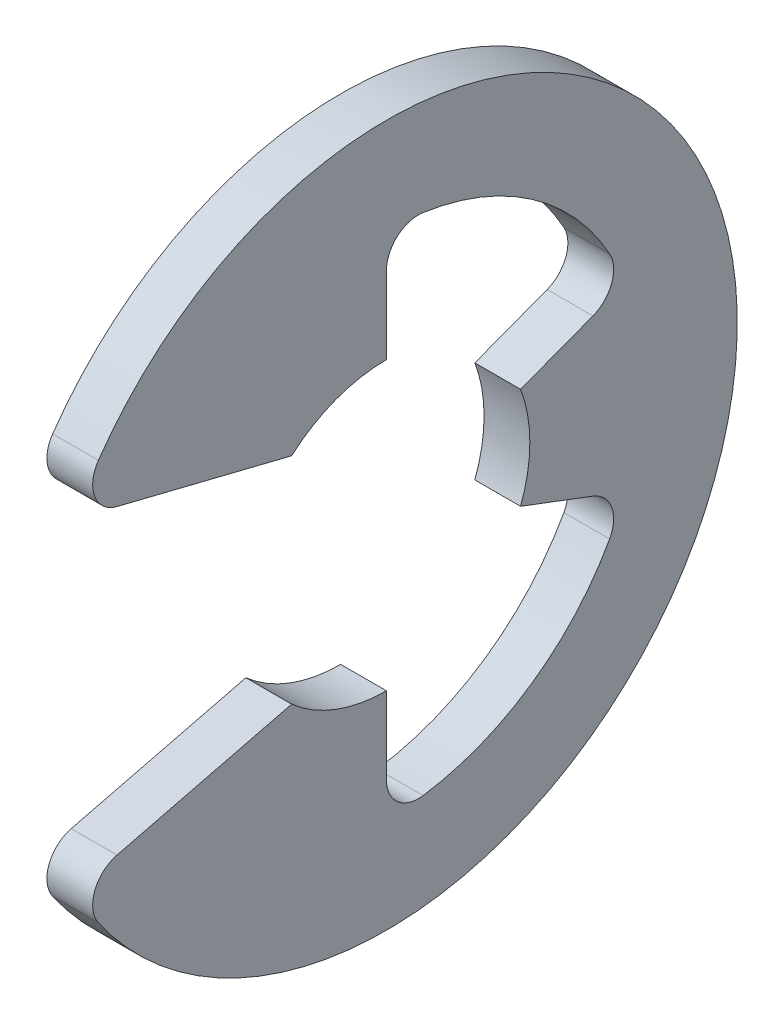
ISO-10303-21;
HEADER;
FILE_DESCRIPTION(('STEP AP214'),'2;1');
FILE_NAME('part.step','',(''),(''),'','','');
FILE_SCHEMA(('AUTOMOTIVE_DESIGN { 1 0 10303 214 1 1 1 1 }'));
ENDSEC;
DATA;
#1=APPLICATION_CONTEXT('core data for automotive mechanical design processes');
#2=APPLICATION_PROTOCOL_DEFINITION('international standard','automotive_design',2000,#1);
#3=PRODUCT_CONTEXT('',#1,'mechanical');
#4=PRODUCT('Part','Part','',(#3));
#5=PRODUCT_RELATED_PRODUCT_CATEGORY('part','',(#4));
#6=PRODUCT_DEFINITION_FORMATION('','',#4);
#7=PRODUCT_DEFINITION_CONTEXT('part definition',#1,'design');
#8=PRODUCT_DEFINITION('design','',#6,#7);
#9=PRODUCT_DEFINITION_SHAPE('','',#8);
#10=(LENGTH_UNIT() NAMED_UNIT(*) SI_UNIT(.MILLI.,.METRE.));
#11=(NAMED_UNIT(*) PLANE_ANGLE_UNIT() SI_UNIT($,.RADIAN.));
#12=(NAMED_UNIT(*) SI_UNIT($,.STERADIAN.) SOLID_ANGLE_UNIT());
#13=UNCERTAINTY_MEASURE_WITH_UNIT(LENGTH_MEASURE(1.E-05),#10,'distance_accuracy_value','');
#14=(GEOMETRIC_REPRESENTATION_CONTEXT(3) GLOBAL_UNCERTAINTY_ASSIGNED_CONTEXT((#13)) GLOBAL_UNIT_ASSIGNED_CONTEXT((#10,
#11,#12)) REPRESENTATION_CONTEXT('',''));
#15=CARTESIAN_POINT('',(0.,0.,0.));
#16=DIRECTION('',(0.,0.,1.));
#17=DIRECTION('',(1.,0.,0.));
#18=AXIS2_PLACEMENT_3D('',#15,#16,#17);
#19=CARTESIAN_POINT('',(0.1905,0.,0.));
#20=DIRECTION('',(-1.,0.,0.));
#21=DIRECTION('',(0.,0.,1.));
#22=AXIS2_PLACEMENT_3D('',#19,#20,#21);
#23=CYLINDRICAL_SURFACE('',#22,2.921);
#24=CARTESIAN_POINT('',(0.1905,0.,0.));
#25=DIRECTION('',(1.,0.,0.));
#26=DIRECTION('',(0.,0.,-1.));
#27=AXIS2_PLACEMENT_3D('',#24,#25,#26);
#28=CIRCLE('',#27,2.921);
#29=CARTESIAN_POINT('',(0.1905,-1.66741220680245,2.3983280702619));
#30=VERTEX_POINT('',#29);
#31=CARTESIAN_POINT('',(0.1905,1.66741220680245,2.3983280702619));
#32=VERTEX_POINT('',#31);
#33=EDGE_CURVE('E172',#30,#32,#28,.T.);
#34=ORIENTED_EDGE('',*,*,#33,.F.);
#35=DIRECTION('',(-1.,0.,0.));
#36=VECTOR('',#35,1.);
#37=CARTESIAN_POINT('',(0.1905,-1.66741220680245,2.3983280702619));
#38=LINE('',#37,#36);
#39=CARTESIAN_POINT('',(-0.1905,-1.66741220680245,2.3983280702619));
#40=VERTEX_POINT('',#39);
#41=EDGE_CURVE('E266',#30,#40,#38,.T.);
#42=ORIENTED_EDGE('',*,*,#41,.T.);
#43=CARTESIAN_POINT('',(-0.1905,0.,0.));
#44=DIRECTION('',(1.,0.,0.));
#45=DIRECTION('',(0.,0.,-1.));
#46=AXIS2_PLACEMENT_3D('',#43,#44,#45);
#47=CIRCLE('',#46,2.921);
#48=CARTESIAN_POINT('',(-0.1905,1.66741220680245,2.3983280702619));
#49=VERTEX_POINT('',#48);
#50=EDGE_CURVE('E210',#40,#49,#47,.T.);
#51=ORIENTED_EDGE('',*,*,#50,.T.);
#52=DIRECTION('',(-1.,0.,0.));
#53=VECTOR('',#52,1.);
#54=CARTESIAN_POINT('',(0.1905,1.66741220680245,2.3983280702619));
#55=LINE('',#54,#53);
#56=EDGE_CURVE('E264',#49,#32,#55,.F.);
#57=ORIENTED_EDGE('',*,*,#56,.T.);
#58=EDGE_LOOP('',(#34,#42,#51,#57));
#59=FACE_BOUND('',#58,.T.);
#60=ADVANCED_FACE('F34',(#59),#23,.T.);
#61=CARTESIAN_POINT('',(0.1905,1.34327136462124,2.59381245293267));
#62=DIRECTION('',(0.,0.970536829925373,-0.240952820606873));
#63=DIRECTION('',(0.,0.240952820606873,0.970536829925373));
#64=AXIS2_PLACEMENT_3D('',#61,#62,#63);
#65=PLANE('',#64);
#66=DIRECTION('',(0.,-0.240952820606873,-0.970536829925373));
#67=VECTOR('',#66,1.);
#68=CARTESIAN_POINT('',(0.1905,1.34327136462124,2.59381245293267));
#69=LINE('',#68,#67);
#70=CARTESIAN_POINT('',(0.1905,1.256328050162,2.24361240718949));
#71=VERTEX_POINT('',#70);
#72=CARTESIAN_POINT('',(0.1905,0.89535,0.789624478787227));
#73=VERTEX_POINT('',#72);
#74=EDGE_CURVE('E158',#71,#73,#69,.T.);
#75=ORIENTED_EDGE('',*,*,#74,.F.);
#76=DIRECTION('',(-1.,0.,0.));
#77=VECTOR('',#76,1.);
#78=CARTESIAN_POINT('',(0.1905,1.256328050162,2.24361240718949));
#79=LINE('',#78,#77);
#80=CARTESIAN_POINT('',(-0.1905,1.256328050162,2.24361240718949));
#81=VERTEX_POINT('',#80);
#82=EDGE_CURVE('E278',#71,#81,#79,.T.);
#83=ORIENTED_EDGE('',*,*,#82,.T.);
#84=DIRECTION('',(0.,-0.240952820606873,-0.970536829925373));
#85=VECTOR('',#84,1.);
#86=CARTESIAN_POINT('',(-0.1905,1.34327136462124,2.59381245293267));
#87=LINE('',#86,#85);
#88=CARTESIAN_POINT('',(-0.1905,0.89535,0.789624478787227));
#89=VERTEX_POINT('',#88);
#90=EDGE_CURVE('E178',#81,#89,#87,.T.);
#91=ORIENTED_EDGE('',*,*,#90,.T.);
#92=DIRECTION('',(-1.,0.,0.));
#93=VECTOR('',#92,1.);
#94=CARTESIAN_POINT('',(0.1905,0.89535,0.789624478787227));
#95=LINE('',#94,#93);
#96=EDGE_CURVE('E175',#73,#89,#95,.T.);
#97=ORIENTED_EDGE('',*,*,#96,.F.);
#98=EDGE_LOOP('',(#75,#83,#91,#97));
#99=FACE_BOUND('',#98,.T.);
#100=ADVANCED_FACE('F176',(#99),#65,.F.);
#101=CARTESIAN_POINT('',(0.1905,0.,0.));
#102=DIRECTION('',(-1.,0.,0.));
#103=DIRECTION('',(0.,0.,1.));
#104=AXIS2_PLACEMENT_3D('',#101,#102,#103);
#105=CYLINDRICAL_SURFACE('',#104,1.1938);
#106=CARTESIAN_POINT('',(-0.1905,0.,0.));
#107=DIRECTION('',(-1.,0.,0.));
#108=DIRECTION('',(0.,0.,1.));
#109=AXIS2_PLACEMENT_3D('',#106,#107,#108);
#110=CIRCLE('',#109,1.1938);
#111=CARTESIAN_POINT('',(-0.1905,1.1938,0.));
#112=VERTEX_POINT('',#111);
#113=EDGE_CURVE('E214',#89,#112,#110,.T.);
#114=ORIENTED_EDGE('',*,*,#113,.T.);
#115=DIRECTION('',(-1.,0.,0.));
#116=VECTOR('',#115,1.);
#117=CARTESIAN_POINT('',(0.1905,1.1938,0.));
#118=LINE('',#117,#116);
#119=CARTESIAN_POINT('',(0.1905,1.1938,0.));
#120=VERTEX_POINT('',#119);
#121=EDGE_CURVE('E182',#120,#112,#118,.T.);
#122=ORIENTED_EDGE('',*,*,#121,.F.);
#123=CARTESIAN_POINT('',(0.1905,0.,0.));
#124=DIRECTION('',(-1.,0.,0.));
#125=DIRECTION('',(0.,0.,1.));
#126=AXIS2_PLACEMENT_3D('',#123,#124,#125);
#127=CIRCLE('',#126,1.1938);
#128=EDGE_CURVE('E164',#73,#120,#127,.T.);
#129=ORIENTED_EDGE('',*,*,#128,.F.);
#130=ORIENTED_EDGE('',*,*,#96,.T.);
#131=EDGE_LOOP('',(#114,#122,#129,#130));
#132=FACE_BOUND('',#131,.T.);
#133=ADVANCED_FACE('F184',(#132),#105,.F.);
#134=CARTESIAN_POINT('',(0.1905,1.1938,0.));
#135=DIRECTION('',(0.,0.,1.));
#136=DIRECTION('',(0.,-1.,0.));
#137=AXIS2_PLACEMENT_3D('',#134,#135,#136);
#138=PLANE('',#137);
#139=DIRECTION('',(0.,1.,0.));
#140=VECTOR('',#139,1.);
#141=CARTESIAN_POINT('',(-0.1905,1.1938,0.));
#142=LINE('',#141,#140);
#143=CARTESIAN_POINT('',(-0.1905,1.83781710410404,0.));
#144=VERTEX_POINT('',#143);
#145=EDGE_CURVE('E216',#112,#144,#142,.T.);
#146=ORIENTED_EDGE('',*,*,#145,.T.);
#147=DIRECTION('',(1.,0.,0.));
#148=VECTOR('',#147,1.);
#149=CARTESIAN_POINT('',(0.1905,1.83781710410404,0.));
#150=LINE('',#149,#148);
#151=CARTESIAN_POINT('',(0.1905,1.83781710410404,0.));
#152=VERTEX_POINT('',#151);
#153=EDGE_CURVE('E262',#144,#152,#150,.T.);
#154=ORIENTED_EDGE('',*,*,#153,.T.);
#155=DIRECTION('',(0.,1.,0.));
#156=VECTOR('',#155,1.);
#157=CARTESIAN_POINT('',(0.1905,1.1938,0.));
#158=LINE('',#157,#156);
#159=EDGE_CURVE('E187',#120,#152,#158,.T.);
#160=ORIENTED_EDGE('',*,*,#159,.F.);
#161=ORIENTED_EDGE('',*,*,#121,.T.);
#162=EDGE_LOOP('',(#146,#154,#160,#161));
#163=FACE_BOUND('',#162,.T.);
#164=ADVANCED_FACE('F384',(#163),#138,.F.);
#165=CARTESIAN_POINT('',(0.1905,0.,0.));
#166=DIRECTION('',(-1.,0.,0.));
#167=DIRECTION('',(0.,0.,1.));
#168=AXIS2_PLACEMENT_3D('',#165,#166,#167);
#169=CYLINDRICAL_SURFACE('',#168,2.12376774193548);
#170=CARTESIAN_POINT('',(0.1905,0.,0.));
#171=DIRECTION('',(-1.,0.,0.));
#172=DIRECTION('',(0.,0.,-1.));
#173=AXIS2_PLACEMENT_3D('',#170,#171,#172);
#174=CIRCLE('',#173,2.12376774193548);
#175=CARTESIAN_POINT('',(0.1905,2.10175245260872,-0.305001720714758));
#176=VERTEX_POINT('',#175);
#177=CARTESIAN_POINT('',(0.1905,1.02838469113033,-1.85817500487293));
#178=VERTEX_POINT('',#177);
#179=EDGE_CURVE('E189',#176,#178,#174,.T.);
#180=ORIENTED_EDGE('',*,*,#179,.F.);
#181=DIRECTION('',(-1.,0.,0.));
#182=VECTOR('',#181,1.);
#183=CARTESIAN_POINT('',(0.1905,2.10175245260872,-0.305001720714758));
#184=LINE('',#183,#182);
#185=CARTESIAN_POINT('',(-0.1905,2.10175245260872,-0.305001720714758));
#186=VERTEX_POINT('',#185);
#187=EDGE_CURVE('E259',#176,#186,#184,.T.);
#188=ORIENTED_EDGE('',*,*,#187,.T.);
#189=CARTESIAN_POINT('',(-0.1905,0.,0.));
#190=DIRECTION('',(-1.,0.,0.));
#191=DIRECTION('',(0.,0.,-1.));
#192=AXIS2_PLACEMENT_3D('',#189,#190,#191);
#193=CIRCLE('',#192,2.12376774193548);
#194=CARTESIAN_POINT('',(-0.1905,1.02838469113033,-1.85817500487293));
#195=VERTEX_POINT('',#194);
#196=EDGE_CURVE('E219',#186,#195,#193,.T.);
#197=ORIENTED_EDGE('',*,*,#196,.T.);
#198=DIRECTION('',(-1.,0.,0.));
#199=VECTOR('',#198,1.);
#200=CARTESIAN_POINT('',(0.1905,1.02838469113033,-1.85817500487293));
#201=LINE('',#200,#199);
#202=EDGE_CURVE('E257',#195,#178,#201,.F.);
#203=ORIENTED_EDGE('',*,*,#202,.T.);
#204=EDGE_LOOP('',(#180,#188,#197,#203));
#205=FACE_BOUND('',#204,.T.);
#206=ADVANCED_FACE('F306',(#205),#169,.F.);
#207=CARTESIAN_POINT('',(0.1905,0.42207203769025,-1.11669764708268));
#208=DIRECTION('',(0.,-0.935414346693485,-0.353553390593274));
#209=DIRECTION('',(0.,0.353553390593274,-0.935414346693485));
#210=AXIS2_PLACEMENT_3D('',#207,#208,#209);
#211=PLANE('',#210);
#212=DIRECTION('',(0.,-0.353553390593274,0.935414346693485));
#213=VECTOR('',#212,1.);
#214=CARTESIAN_POINT('',(0.1905,0.42207203769025,-1.11669764708268));
#215=LINE('',#214,#213);
#216=CARTESIAN_POINT('',(0.1905,0.649766468446294,-1.71912048577759));
#217=VERTEX_POINT('',#216);
#218=CARTESIAN_POINT('',(0.1905,0.42207203769025,-1.11669764708268));
#219=VERTEX_POINT('',#218);
#220=EDGE_CURVE('E194',#217,#219,#215,.T.);
#221=ORIENTED_EDGE('',*,*,#220,.F.);
#222=DIRECTION('',(1.,0.,0.));
#223=VECTOR('',#222,1.);
#224=CARTESIAN_POINT('',(-0.1905,0.649766468446294,-1.71912048577759));
#225=LINE('',#224,#223);
#226=CARTESIAN_POINT('',(-0.1905,0.649766468446294,-1.71912048577759));
#227=VERTEX_POINT('',#226);
#228=EDGE_CURVE('E281',#217,#227,#225,.F.);
#229=ORIENTED_EDGE('',*,*,#228,.T.);
#230=DIRECTION('',(0.,-0.353553390593274,0.935414346693485));
#231=VECTOR('',#230,1.);
#232=CARTESIAN_POINT('',(-0.1905,0.42207203769025,-1.11669764708268));
#233=LINE('',#232,#231);
#234=CARTESIAN_POINT('',(-0.1905,0.42207203769025,-1.11669764708268));
#235=VERTEX_POINT('',#234);
#236=EDGE_CURVE('E222',#227,#235,#233,.T.);
#237=ORIENTED_EDGE('',*,*,#236,.T.);
#238=DIRECTION('',(-1.,0.,0.));
#239=VECTOR('',#238,1.);
#240=CARTESIAN_POINT('',(0.1905,0.42207203769025,-1.11669764708268));
#241=LINE('',#240,#239);
#242=EDGE_CURVE('E246',#219,#235,#241,.T.);
#243=ORIENTED_EDGE('',*,*,#242,.F.);
#244=EDGE_LOOP('',(#221,#229,#237,#243));
#245=FACE_BOUND('',#244,.T.);
#246=ADVANCED_FACE('F309',(#245),#211,.F.);
#247=CARTESIAN_POINT('',(0.1905,0.,0.));
#248=DIRECTION('',(-1.,0.,0.));
#249=DIRECTION('',(0.,0.,1.));
#250=AXIS2_PLACEMENT_3D('',#247,#248,#249);
#251=CYLINDRICAL_SURFACE('',#250,1.1938);
#252=CARTESIAN_POINT('',(-0.1905,0.,0.));
#253=DIRECTION('',(-1.,0.,0.));
#254=DIRECTION('',(0.,0.,1.));
#255=AXIS2_PLACEMENT_3D('',#252,#253,#254);
#256=CIRCLE('',#255,1.1938);
#257=CARTESIAN_POINT('',(-0.1905,-0.42207203769025,-1.11669764708268));
#258=VERTEX_POINT('',#257);
#259=EDGE_CURVE('E224',#235,#258,#256,.T.);
#260=ORIENTED_EDGE('',*,*,#259,.T.);
#261=DIRECTION('',(-1.,0.,0.));
#262=VECTOR('',#261,1.);
#263=CARTESIAN_POINT('',(0.1905,-0.42207203769025,-1.11669764708268));
#264=LINE('',#263,#262);
#265=CARTESIAN_POINT('',(0.1905,-0.42207203769025,-1.11669764708268));
#266=VERTEX_POINT('',#265);
#267=EDGE_CURVE('E243',#266,#258,#264,.T.);
#268=ORIENTED_EDGE('',*,*,#267,.F.);
#269=CARTESIAN_POINT('',(0.1905,0.,0.));
#270=DIRECTION('',(-1.,0.,0.));
#271=DIRECTION('',(0.,0.,1.));
#272=AXIS2_PLACEMENT_3D('',#269,#270,#271);
#273=CIRCLE('',#272,1.1938);
#274=EDGE_CURVE('E196',#219,#266,#273,.T.);
#275=ORIENTED_EDGE('',*,*,#274,.F.);
#276=ORIENTED_EDGE('',*,*,#242,.T.);
#277=EDGE_LOOP('',(#260,#268,#275,#276));
#278=FACE_BOUND('',#277,.T.);
#279=ADVANCED_FACE('F315',(#278),#251,.F.);
#280=CARTESIAN_POINT('',(0.1905,-0.42207203769025,-1.11669764708268));
#281=DIRECTION('',(0.,0.935414346693485,-0.353553390593273));
#282=DIRECTION('',(0.,0.353553390593273,0.935414346693485));
#283=AXIS2_PLACEMENT_3D('',#280,#281,#282);
#284=PLANE('',#283);
#285=DIRECTION('',(0.,-0.353553390593273,-0.935414346693485));
#286=VECTOR('',#285,1.);
#287=CARTESIAN_POINT('',(-0.1905,-0.42207203769025,-1.11669764708268));
#288=LINE('',#287,#286);
#289=CARTESIAN_POINT('',(-0.1905,-0.649766468446294,-1.71912048577759));
#290=VERTEX_POINT('',#289);
#291=EDGE_CURVE('E226',#258,#290,#288,.T.);
#292=ORIENTED_EDGE('',*,*,#291,.T.);
#293=DIRECTION('',(1.,0.,0.));
#294=VECTOR('',#293,1.);
#295=CARTESIAN_POINT('',(0.1905,-0.649766468446294,-1.71912048577759));
#296=LINE('',#295,#294);
#297=CARTESIAN_POINT('',(0.1905,-0.649766468446294,-1.71912048577759));
#298=VERTEX_POINT('',#297);
#299=EDGE_CURVE('E49',#290,#298,#296,.T.);
#300=ORIENTED_EDGE('',*,*,#299,.T.);
#301=DIRECTION('',(0.,-0.353553390593273,-0.935414346693485));
#302=VECTOR('',#301,1.);
#303=CARTESIAN_POINT('',(0.1905,-0.42207203769025,-1.11669764708268));
#304=LINE('',#303,#302);
#305=EDGE_CURVE('E198',#266,#298,#304,.T.);
#306=ORIENTED_EDGE('',*,*,#305,.F.);
#307=ORIENTED_EDGE('',*,*,#267,.T.);
#308=EDGE_LOOP('',(#292,#300,#306,#307));
#309=FACE_BOUND('',#308,.T.);
#310=ADVANCED_FACE('F317',(#309),#284,.F.);
#311=CARTESIAN_POINT('',(0.1905,0.,0.));
#312=DIRECTION('',(-1.,0.,0.));
#313=DIRECTION('',(0.,0.,1.));
#314=AXIS2_PLACEMENT_3D('',#311,#312,#313);
#315=CYLINDRICAL_SURFACE('',#314,2.12376774193548);
#316=CARTESIAN_POINT('',(-0.1905,0.,0.));
#317=DIRECTION('',(-1.,0.,0.));
#318=DIRECTION('',(0.,0.,-1.));
#319=AXIS2_PLACEMENT_3D('',#316,#317,#318);
#320=CIRCLE('',#319,2.12376774193548);
#321=CARTESIAN_POINT('',(-0.1905,-1.02838469113033,-1.85817500487293));
#322=VERTEX_POINT('',#321);
#323=CARTESIAN_POINT('',(-0.1905,-2.10175245260872,-0.305001720714758));
#324=VERTEX_POINT('',#323);
#325=EDGE_CURVE('E228',#322,#324,#320,.T.);
#326=ORIENTED_EDGE('',*,*,#325,.T.);
#327=DIRECTION('',(-1.,0.,0.));
#328=VECTOR('',#327,1.);
#329=CARTESIAN_POINT('',(0.1905,-2.10175245260872,-0.305001720714758));
#330=LINE('',#329,#328);
#331=CARTESIAN_POINT('',(0.1905,-2.10175245260872,-0.305001720714758));
#332=VERTEX_POINT('',#331);
#333=EDGE_CURVE('E255',#324,#332,#330,.F.);
#334=ORIENTED_EDGE('',*,*,#333,.T.);
#335=CARTESIAN_POINT('',(0.1905,0.,0.));
#336=DIRECTION('',(-1.,0.,0.));
#337=DIRECTION('',(0.,0.,-1.));
#338=AXIS2_PLACEMENT_3D('',#335,#336,#337);
#339=CIRCLE('',#338,2.12376774193548);
#340=CARTESIAN_POINT('',(0.1905,-1.02838469113033,-1.85817500487293));
#341=VERTEX_POINT('',#340);
#342=EDGE_CURVE('E200',#341,#332,#339,.T.);
#343=ORIENTED_EDGE('',*,*,#342,.F.);
#344=DIRECTION('',(-1.,0.,0.));
#345=VECTOR('',#344,1.);
#346=CARTESIAN_POINT('',(0.1905,-1.02838469113033,-1.85817500487293));
#347=LINE('',#346,#345);
#348=EDGE_CURVE('E252',#341,#322,#347,.T.);
#349=ORIENTED_EDGE('',*,*,#348,.T.);
#350=EDGE_LOOP('',(#326,#334,#343,#349));
#351=FACE_BOUND('',#350,.T.);
#352=ADVANCED_FACE('F319',(#351),#315,.F.);
#353=CARTESIAN_POINT('',(0.1905,-1.1938,0.));
#354=DIRECTION('',(0.,0.,1.));
#355=DIRECTION('',(0.,-1.,0.));
#356=AXIS2_PLACEMENT_3D('',#353,#354,#355);
#357=PLANE('',#356);
#358=DIRECTION('',(0.,1.,0.));
#359=VECTOR('',#358,1.);
#360=CARTESIAN_POINT('',(0.1905,-1.1938,0.));
#361=LINE('',#360,#359);
#362=CARTESIAN_POINT('',(0.1905,-1.83781710410404,0.));
#363=VERTEX_POINT('',#362);
#364=CARTESIAN_POINT('',(0.1905,-1.1938,0.));
#365=VERTEX_POINT('',#364);
#366=EDGE_CURVE('E203',#363,#365,#361,.T.);
#367=ORIENTED_EDGE('',*,*,#366,.F.);
#368=DIRECTION('',(1.,0.,0.));
#369=VECTOR('',#368,1.);
#370=CARTESIAN_POINT('',(-0.1905,-1.83781710410404,0.));
#371=LINE('',#370,#369);
#372=CARTESIAN_POINT('',(-0.1905,-1.83781710410404,0.));
#373=VERTEX_POINT('',#372);
#374=EDGE_CURVE('E181',#363,#373,#371,.F.);
#375=ORIENTED_EDGE('',*,*,#374,.T.);
#376=DIRECTION('',(0.,1.,0.));
#377=VECTOR('',#376,1.);
#378=CARTESIAN_POINT('',(-0.1905,-1.1938,0.));
#379=LINE('',#378,#377);
#380=CARTESIAN_POINT('',(-0.1905,-1.1938,0.));
#381=VERTEX_POINT('',#380);
#382=EDGE_CURVE('E231',#373,#381,#379,.T.);
#383=ORIENTED_EDGE('',*,*,#382,.T.);
#384=DIRECTION('',(-1.,0.,0.));
#385=VECTOR('',#384,1.);
#386=CARTESIAN_POINT('',(0.1905,-1.1938,0.));
#387=LINE('',#386,#385);
#388=EDGE_CURVE('E240',#365,#381,#387,.T.);
#389=ORIENTED_EDGE('',*,*,#388,.F.);
#390=EDGE_LOOP('',(#367,#375,#383,#389));
#391=FACE_BOUND('',#390,.T.);
#392=ADVANCED_FACE('F325',(#391),#357,.F.);
#393=CARTESIAN_POINT('',(0.1905,0.,0.));
#394=DIRECTION('',(-1.,0.,0.));
#395=DIRECTION('',(0.,0.,1.));
#396=AXIS2_PLACEMENT_3D('',#393,#394,#395);
#397=CYLINDRICAL_SURFACE('',#396,1.1938);
#398=CARTESIAN_POINT('',(-0.1905,0.,0.));
#399=DIRECTION('',(-1.,0.,0.));
#400=DIRECTION('',(0.,0.,-1.));
#401=AXIS2_PLACEMENT_3D('',#398,#399,#400);
#402=CIRCLE('',#401,1.1938);
#403=CARTESIAN_POINT('',(-0.1905,-0.89535,0.789624478787227));
#404=VERTEX_POINT('',#403);
#405=EDGE_CURVE('E233',#381,#404,#402,.T.);
#406=ORIENTED_EDGE('',*,*,#405,.T.);
#407=DIRECTION('',(-1.,0.,0.));
#408=VECTOR('',#407,1.);
#409=CARTESIAN_POINT('',(0.1905,-0.89535,0.789624478787227));
#410=LINE('',#409,#408);
#411=CARTESIAN_POINT('',(0.1905,-0.89535,0.789624478787227));
#412=VERTEX_POINT('',#411);
#413=EDGE_CURVE('E209',#412,#404,#410,.T.);
#414=ORIENTED_EDGE('',*,*,#413,.F.);
#415=CARTESIAN_POINT('',(0.1905,0.,0.));
#416=DIRECTION('',(-1.,0.,0.));
#417=DIRECTION('',(0.,0.,-1.));
#418=AXIS2_PLACEMENT_3D('',#415,#416,#417);
#419=CIRCLE('',#418,1.1938);
#420=EDGE_CURVE('E205',#365,#412,#419,.T.);
#421=ORIENTED_EDGE('',*,*,#420,.F.);
#422=ORIENTED_EDGE('',*,*,#388,.T.);
#423=EDGE_LOOP('',(#406,#414,#421,#422));
#424=FACE_BOUND('',#423,.T.);
#425=ADVANCED_FACE('F374',(#424),#397,.F.);
#426=CARTESIAN_POINT('',(0.1905,-1.34327136462124,2.59381245293267));
#427=DIRECTION('',(0.,-0.970536829925373,-0.240952820606873));
#428=DIRECTION('',(0.,0.240952820606873,-0.970536829925373));
#429=AXIS2_PLACEMENT_3D('',#426,#427,#428);
#430=PLANE('',#429);
#431=DIRECTION('',(0.,-0.240952820606873,0.970536829925373));
#432=VECTOR('',#431,1.);
#433=CARTESIAN_POINT('',(-0.1905,-1.34327136462124,2.59381245293267));
#434=LINE('',#433,#432);
#435=CARTESIAN_POINT('',(-0.1905,-1.256328050162,2.24361240718949));
#436=VERTEX_POINT('',#435);
#437=EDGE_CURVE('E235',#404,#436,#434,.T.);
#438=ORIENTED_EDGE('',*,*,#437,.T.);
#439=DIRECTION('',(-1.,0.,0.));
#440=VECTOR('',#439,1.);
#441=CARTESIAN_POINT('',(0.1905,-1.256328050162,2.24361240718949));
#442=LINE('',#441,#440);
#443=CARTESIAN_POINT('',(0.1905,-1.256328050162,2.24361240718949));
#444=VERTEX_POINT('',#443);
#445=EDGE_CURVE('E273',#436,#444,#442,.F.);
#446=ORIENTED_EDGE('',*,*,#445,.T.);
#447=DIRECTION('',(0.,-0.240952820606873,0.970536829925373));
#448=VECTOR('',#447,1.);
#449=CARTESIAN_POINT('',(0.1905,-1.34327136462124,2.59381245293267));
#450=LINE('',#449,#448);
#451=EDGE_CURVE('E207',#412,#444,#450,.T.);
#452=ORIENTED_EDGE('',*,*,#451,.F.);
#453=ORIENTED_EDGE('',*,*,#413,.T.);
#454=EDGE_LOOP('',(#438,#446,#452,#453));
#455=FACE_BOUND('',#454,.T.);
#456=ADVANCED_FACE('F416',(#455),#430,.F.);
#457=CARTESIAN_POINT('',(0.1905,0.,0.));
#458=DIRECTION('',(1.,0.,0.));
#459=DIRECTION('',(0.,0.,-1.));
#460=AXIS2_PLACEMENT_3D('',#457,#458,#459);
#461=PLANE('',#460);
#462=ORIENTED_EDGE('',*,*,#451,.T.);
#463=CARTESIAN_POINT('',(0.1905,-1.5151702227031,2.17935028993364));
#464=DIRECTION('',(1.,0.,0.));
#465=DIRECTION('',(0.,0.,-1.));
#466=AXIS2_PLACEMENT_3D('',#463,#464,#465);
#467=CIRCLE('',#466,0.2667);
#468=EDGE_CURVE('E276',#444,#30,#467,.T.);
#469=ORIENTED_EDGE('',*,*,#468,.T.);
#470=ORIENTED_EDGE('',*,*,#33,.T.);
#471=CARTESIAN_POINT('',(0.1905,1.5151702227031,2.17935028993364));
#472=DIRECTION('',(1.,0.,0.));
#473=DIRECTION('',(0.,0.,-1.));
#474=AXIS2_PLACEMENT_3D('',#471,#472,#473);
#475=CIRCLE('',#474,0.2667);
#476=EDGE_CURVE('E168',#32,#71,#475,.T.);
#477=ORIENTED_EDGE('',*,*,#476,.T.);
#478=ORIENTED_EDGE('',*,*,#74,.T.);
#479=ORIENTED_EDGE('',*,*,#128,.T.);
#480=ORIENTED_EDGE('',*,*,#159,.T.);
#481=CARTESIAN_POINT('',(0.1905,1.83781710410404,-0.266699999999999));
#482=DIRECTION('',(1.,0.,0.));
#483=DIRECTION('',(0.,0.,-1.));
#484=AXIS2_PLACEMENT_3D('',#481,#482,#483);
#485=CIRCLE('',#484,0.2667);
#486=EDGE_CURVE('E290',#152,#176,#485,.F.);
#487=ORIENTED_EDGE('',*,*,#486,.T.);
#488=ORIENTED_EDGE('',*,*,#179,.T.);
#489=CARTESIAN_POINT('',(0.1905,0.899241474709447,-1.62482779650637));
#490=DIRECTION('',(1.,0.,0.));
#491=DIRECTION('',(0.,0.,-1.));
#492=AXIS2_PLACEMENT_3D('',#489,#490,#491);
#493=CIRCLE('',#492,0.2667);
#494=EDGE_CURVE('E11',#178,#217,#493,.F.);
#495=ORIENTED_EDGE('',*,*,#494,.T.);
#496=ORIENTED_EDGE('',*,*,#220,.T.);
#497=ORIENTED_EDGE('',*,*,#274,.T.);
#498=ORIENTED_EDGE('',*,*,#305,.T.);
#499=CARTESIAN_POINT('',(0.1905,-0.899241474709446,-1.62482779650637));
#500=DIRECTION('',(1.,0.,0.));
#501=DIRECTION('',(0.,0.,-1.));
#502=AXIS2_PLACEMENT_3D('',#499,#500,#501);
#503=CIRCLE('',#502,0.2667);
#504=EDGE_CURVE('E294',#298,#341,#503,.F.);
#505=ORIENTED_EDGE('',*,*,#504,.T.);
#506=ORIENTED_EDGE('',*,*,#342,.T.);
#507=CARTESIAN_POINT('',(0.1905,-1.83781710410404,-0.2667));
#508=DIRECTION('',(1.,0.,0.));
#509=DIRECTION('',(0.,0.,-1.));
#510=AXIS2_PLACEMENT_3D('',#507,#508,#509);
#511=CIRCLE('',#510,0.2667);
#512=EDGE_CURVE('E286',#332,#363,#511,.F.);
#513=ORIENTED_EDGE('',*,*,#512,.T.);
#514=ORIENTED_EDGE('',*,*,#366,.T.);
#515=ORIENTED_EDGE('',*,*,#420,.T.);
#516=EDGE_LOOP('',(#462,#469,#470,#477,#478,#479,#480,#487,#488,#495,#496,#497,#498,#505,#506,
#513,#514,#515));
#517=FACE_BOUND('',#516,.T.);
#518=ADVANCED_FACE('F161',(#517),#461,.T.);
#519=CARTESIAN_POINT('',(-0.1905,0.,0.));
#520=DIRECTION('',(1.,0.,0.));
#521=DIRECTION('',(0.,0.,-1.));
#522=AXIS2_PLACEMENT_3D('',#519,#520,#521);
#523=PLANE('',#522);
#524=ORIENTED_EDGE('',*,*,#50,.F.);
#525=CARTESIAN_POINT('',(-0.1905,-1.5151702227031,2.17935028993364));
#526=DIRECTION('',(1.,0.,0.));
#527=DIRECTION('',(0.,0.,-1.));
#528=AXIS2_PLACEMENT_3D('',#525,#526,#527);
#529=CIRCLE('',#528,0.2667);
#530=EDGE_CURVE('E271',#40,#436,#529,.F.);
#531=ORIENTED_EDGE('',*,*,#530,.T.);
#532=ORIENTED_EDGE('',*,*,#437,.F.);
#533=ORIENTED_EDGE('',*,*,#405,.F.);
#534=ORIENTED_EDGE('',*,*,#382,.F.);
#535=CARTESIAN_POINT('',(-0.1905,-1.83781710410404,-0.2667));
#536=DIRECTION('',(1.,0.,0.));
#537=DIRECTION('',(0.,0.,-1.));
#538=AXIS2_PLACEMENT_3D('',#535,#536,#537);
#539=CIRCLE('',#538,0.2667);
#540=EDGE_CURVE('E284',#373,#324,#539,.T.);
#541=ORIENTED_EDGE('',*,*,#540,.T.);
#542=ORIENTED_EDGE('',*,*,#325,.F.);
#543=CARTESIAN_POINT('',(-0.1905,-0.899241474709446,-1.62482779650637));
#544=DIRECTION('',(1.,0.,0.));
#545=DIRECTION('',(0.,0.,-1.));
#546=AXIS2_PLACEMENT_3D('',#543,#544,#545);
#547=CIRCLE('',#546,0.2667);
#548=EDGE_CURVE('E292',#322,#290,#547,.T.);
#549=ORIENTED_EDGE('',*,*,#548,.T.);
#550=ORIENTED_EDGE('',*,*,#291,.F.);
#551=ORIENTED_EDGE('',*,*,#259,.F.);
#552=ORIENTED_EDGE('',*,*,#236,.F.);
#553=CARTESIAN_POINT('',(-0.1905,0.899241474709447,-1.62482779650637));
#554=DIRECTION('',(1.,0.,0.));
#555=DIRECTION('',(0.,0.,-1.));
#556=AXIS2_PLACEMENT_3D('',#553,#554,#555);
#557=CIRCLE('',#556,0.2667);
#558=EDGE_CURVE('E42',#227,#195,#557,.T.);
#559=ORIENTED_EDGE('',*,*,#558,.T.);
#560=ORIENTED_EDGE('',*,*,#196,.F.);
#561=CARTESIAN_POINT('',(-0.1905,1.83781710410404,-0.266699999999999));
#562=DIRECTION('',(1.,0.,0.));
#563=DIRECTION('',(0.,0.,-1.));
#564=AXIS2_PLACEMENT_3D('',#561,#562,#563);
#565=CIRCLE('',#564,0.2667);
#566=EDGE_CURVE('E288',#186,#144,#565,.T.);
#567=ORIENTED_EDGE('',*,*,#566,.T.);
#568=ORIENTED_EDGE('',*,*,#145,.F.);
#569=ORIENTED_EDGE('',*,*,#113,.F.);
#570=ORIENTED_EDGE('',*,*,#90,.F.);
#571=CARTESIAN_POINT('',(-0.1905,1.5151702227031,2.17935028993364));
#572=DIRECTION('',(1.,0.,0.));
#573=DIRECTION('',(0.,0.,-1.));
#574=AXIS2_PLACEMENT_3D('',#571,#572,#573);
#575=CIRCLE('',#574,0.2667);
#576=EDGE_CURVE('E269',#81,#49,#575,.F.);
#577=ORIENTED_EDGE('',*,*,#576,.T.);
#578=EDGE_LOOP('',(#524,#531,#532,#533,#534,#541,#542,#549,#550,#551,#552,#559,#560,#567,#568,
#569,#570,#577));
#579=FACE_BOUND('',#578,.T.);
#580=ADVANCED_FACE('F299',(#579),#523,.F.);
#581=CARTESIAN_POINT('',(0.1905,-1.83781710410404,-0.2667));
#582=DIRECTION('',(-1.,0.,0.));
#583=DIRECTION('',(0.,0.,1.));
#584=AXIS2_PLACEMENT_3D('',#581,#582,#583);
#585=CYLINDRICAL_SURFACE('',#584,0.2667);
#586=ORIENTED_EDGE('',*,*,#512,.F.);
#587=ORIENTED_EDGE('',*,*,#333,.F.);
#588=ORIENTED_EDGE('',*,*,#540,.F.);
#589=ORIENTED_EDGE('',*,*,#374,.F.);
#590=EDGE_LOOP('',(#586,#587,#588,#589));
#591=FACE_BOUND('',#590,.T.);
#592=ADVANCED_FACE('F339',(#591),#585,.F.);
#593=CARTESIAN_POINT('',(0.1905,1.83781710410404,-0.266699999999999));
#594=DIRECTION('',(-1.,0.,0.));
#595=DIRECTION('',(0.,0.,1.));
#596=AXIS2_PLACEMENT_3D('',#593,#594,#595);
#597=CYLINDRICAL_SURFACE('',#596,0.2667);
#598=ORIENTED_EDGE('',*,*,#486,.F.);
#599=ORIENTED_EDGE('',*,*,#153,.F.);
#600=ORIENTED_EDGE('',*,*,#566,.F.);
#601=ORIENTED_EDGE('',*,*,#187,.F.);
#602=EDGE_LOOP('',(#598,#599,#600,#601));
#603=FACE_BOUND('',#602,.T.);
#604=ADVANCED_FACE('F342',(#603),#597,.F.);
#605=CARTESIAN_POINT('',(0.1905,-1.5151702227031,2.17935028993364));
#606=DIRECTION('',(-1.,0.,0.));
#607=DIRECTION('',(0.,0.,1.));
#608=AXIS2_PLACEMENT_3D('',#605,#606,#607);
#609=CYLINDRICAL_SURFACE('',#608,0.2667);
#610=ORIENTED_EDGE('',*,*,#468,.F.);
#611=ORIENTED_EDGE('',*,*,#445,.F.);
#612=ORIENTED_EDGE('',*,*,#530,.F.);
#613=ORIENTED_EDGE('',*,*,#41,.F.);
#614=EDGE_LOOP('',(#610,#611,#612,#613));
#615=FACE_BOUND('',#614,.T.);
#616=ADVANCED_FACE('F346',(#615),#609,.T.);
#617=CARTESIAN_POINT('',(0.1905,1.5151702227031,2.17935028993364));
#618=DIRECTION('',(-1.,0.,0.));
#619=DIRECTION('',(0.,0.,1.));
#620=AXIS2_PLACEMENT_3D('',#617,#618,#619);
#621=CYLINDRICAL_SURFACE('',#620,0.2667);
#622=ORIENTED_EDGE('',*,*,#476,.F.);
#623=ORIENTED_EDGE('',*,*,#56,.F.);
#624=ORIENTED_EDGE('',*,*,#576,.F.);
#625=ORIENTED_EDGE('',*,*,#82,.F.);
#626=EDGE_LOOP('',(#622,#623,#624,#625));
#627=FACE_BOUND('',#626,.T.);
#628=ADVANCED_FACE('F350',(#627),#621,.T.);
#629=CARTESIAN_POINT('',(0.1905,-0.899241474709446,-1.62482779650637));
#630=DIRECTION('',(-1.,0.,0.));
#631=DIRECTION('',(0.,0.,1.));
#632=AXIS2_PLACEMENT_3D('',#629,#630,#631);
#633=CYLINDRICAL_SURFACE('',#632,0.2667);
#634=ORIENTED_EDGE('',*,*,#504,.F.);
#635=ORIENTED_EDGE('',*,*,#299,.F.);
#636=ORIENTED_EDGE('',*,*,#548,.F.);
#637=ORIENTED_EDGE('',*,*,#348,.F.);
#638=EDGE_LOOP('',(#634,#635,#636,#637));
#639=FACE_BOUND('',#638,.T.);
#640=ADVANCED_FACE('F353',(#639),#633,.F.);
#641=CARTESIAN_POINT('',(0.1905,0.899241474709447,-1.62482779650637));
#642=DIRECTION('',(-1.,0.,0.));
#643=DIRECTION('',(0.,0.,1.));
#644=AXIS2_PLACEMENT_3D('',#641,#642,#643);
#645=CYLINDRICAL_SURFACE('',#644,0.2667);
#646=ORIENTED_EDGE('',*,*,#494,.F.);
#647=ORIENTED_EDGE('',*,*,#202,.F.);
#648=ORIENTED_EDGE('',*,*,#558,.F.);
#649=ORIENTED_EDGE('',*,*,#228,.F.);
#650=EDGE_LOOP('',(#646,#647,#648,#649));
#651=FACE_BOUND('',#650,.T.);
#652=ADVANCED_FACE('F36',(#651),#645,.F.);
#653=CLOSED_SHELL('',(#60,#100,#133,#164,#206,#246,#279,#310,#352,#392,#425,#456,#518,#580,#592,
#604,#616,#628,#640,#652));
#654=MANIFOLD_SOLID_BREP('B2',#653);
#655=ADVANCED_BREP_SHAPE_REPRESENTATION('',(#18,#654),#14);
#656=SHAPE_DEFINITION_REPRESENTATION(#9,#655);
ENDSEC;
END-ISO-10303-21;
